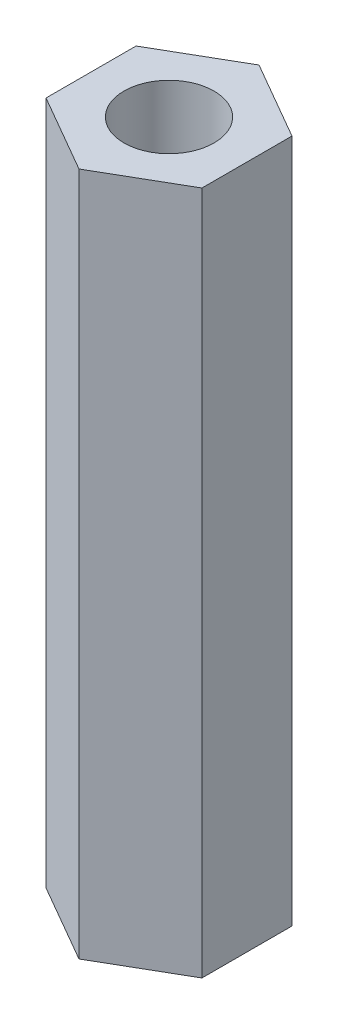
ISO-10303-21;
HEADER;
FILE_DESCRIPTION(('STEP AP214'),'2;1');
FILE_NAME('part.step','',(''),(''),'','','');
FILE_SCHEMA(('AUTOMOTIVE_DESIGN { 1 0 10303 214 1 1 1 1 }'));
ENDSEC;
DATA;
#1=APPLICATION_CONTEXT('core data for automotive mechanical design processes');
#2=APPLICATION_PROTOCOL_DEFINITION('international standard','automotive_design',2000,#1);
#3=PRODUCT_CONTEXT('',#1,'mechanical');
#4=PRODUCT('Part','Part','',(#3));
#5=PRODUCT_RELATED_PRODUCT_CATEGORY('part','',(#4));
#6=PRODUCT_DEFINITION_FORMATION('','',#4);
#7=PRODUCT_DEFINITION_CONTEXT('part definition',#1,'design');
#8=PRODUCT_DEFINITION('design','',#6,#7);
#9=PRODUCT_DEFINITION_SHAPE('','',#8);
#10=(LENGTH_UNIT() NAMED_UNIT(*) SI_UNIT(.MILLI.,.METRE.));
#11=(NAMED_UNIT(*) PLANE_ANGLE_UNIT() SI_UNIT($,.RADIAN.));
#12=(NAMED_UNIT(*) SI_UNIT($,.STERADIAN.) SOLID_ANGLE_UNIT());
#13=UNCERTAINTY_MEASURE_WITH_UNIT(LENGTH_MEASURE(1.E-05),#10,'distance_accuracy_value','');
#14=(GEOMETRIC_REPRESENTATION_CONTEXT(3) GLOBAL_UNCERTAINTY_ASSIGNED_CONTEXT((#13)) GLOBAL_UNIT_ASSIGNED_CONTEXT((#10,
#11,#12)) REPRESENTATION_CONTEXT('',''));
#15=CARTESIAN_POINT('',(0.,0.,0.));
#16=DIRECTION('',(0.,0.,1.));
#17=DIRECTION('',(1.,0.,0.));
#18=AXIS2_PLACEMENT_3D('',#15,#16,#17);
#19=CARTESIAN_POINT('',(0.,38.,-5.));
#20=DIRECTION('',(0.,1.,0.));
#21=DIRECTION('',(0.,0.,1.));
#22=AXIS2_PLACEMENT_3D('',#19,#20,#21);
#23=PLANE('',#22);
#24=DIRECTION('',(-0.866025403784439,0.,-0.5));
#25=VECTOR('',#24,1.);
#26=CARTESIAN_POINT('',(4.33012701892219,38.,-2.5));
#27=LINE('',#26,#25);
#28=CARTESIAN_POINT('',(4.33012701892219,38.,-2.5));
#29=VERTEX_POINT('',#28);
#30=CARTESIAN_POINT('',(0.,38.,-5.));
#31=VERTEX_POINT('',#30);
#32=EDGE_CURVE('E129',#29,#31,#27,.T.);
#33=ORIENTED_EDGE('',*,*,#32,.T.);
#34=DIRECTION('',(-0.866025403784439,0.,0.5));
#35=VECTOR('',#34,1.);
#36=CARTESIAN_POINT('',(0.,38.,-5.));
#37=LINE('',#36,#35);
#38=CARTESIAN_POINT('',(-4.33012701892219,38.,-2.5));
#39=VERTEX_POINT('',#38);
#40=EDGE_CURVE('E87',#31,#39,#37,.T.);
#41=ORIENTED_EDGE('',*,*,#40,.T.);
#42=DIRECTION('',(0.,0.,1.));
#43=VECTOR('',#42,1.);
#44=CARTESIAN_POINT('',(-4.33012701892219,38.,-2.5));
#45=LINE('',#44,#43);
#46=CARTESIAN_POINT('',(-4.33012701892219,38.,2.5));
#47=VERTEX_POINT('',#46);
#48=EDGE_CURVE('E100',#39,#47,#45,.T.);
#49=ORIENTED_EDGE('',*,*,#48,.T.);
#50=DIRECTION('',(0.866025403784439,0.,0.5));
#51=VECTOR('',#50,1.);
#52=CARTESIAN_POINT('',(-4.33012701892219,38.,2.5));
#53=LINE('',#52,#51);
#54=CARTESIAN_POINT('',(0.,38.,5.));
#55=VERTEX_POINT('',#54);
#56=EDGE_CURVE('E94',#47,#55,#53,.T.);
#57=ORIENTED_EDGE('',*,*,#56,.T.);
#58=DIRECTION('',(0.866025403784439,0.,-0.5));
#59=VECTOR('',#58,1.);
#60=CARTESIAN_POINT('',(0.,38.,5.));
#61=LINE('',#60,#59);
#62=CARTESIAN_POINT('',(4.33012701892219,38.,2.5));
#63=VERTEX_POINT('',#62);
#64=EDGE_CURVE('E98',#55,#63,#61,.T.);
#65=ORIENTED_EDGE('',*,*,#64,.T.);
#66=DIRECTION('',(0.,0.,-1.));
#67=VECTOR('',#66,1.);
#68=CARTESIAN_POINT('',(4.33012701892219,38.,2.5));
#69=LINE('',#68,#67);
#70=EDGE_CURVE('E50',#63,#29,#69,.T.);
#71=ORIENTED_EDGE('',*,*,#70,.T.);
#72=EDGE_LOOP('',(#33,#41,#49,#57,#65,#71));
#73=FACE_BOUND('',#72,.T.);
#74=CARTESIAN_POINT('',(0.,38.,0.));
#75=DIRECTION('',(0.,1.,0.));
#76=DIRECTION('',(0.,0.,1.));
#77=AXIS2_PLACEMENT_3D('',#74,#75,#76);
#78=CIRCLE('',#77,2.5);
#79=CARTESIAN_POINT('',(0.,38.,2.5));
#80=VERTEX_POINT('',#79);
#81=EDGE_CURVE('E122',#80,#80,#78,.T.);
#82=ORIENTED_EDGE('',*,*,#81,.F.);
#83=EDGE_LOOP('',(#82));
#84=FACE_BOUND('',#83,.T.);
#85=ADVANCED_FACE('F33',(#73,#84),#23,.T.);
#86=CARTESIAN_POINT('',(0.,0.,-5.));
#87=DIRECTION('',(0.,1.,0.));
#88=DIRECTION('',(0.,0.,1.));
#89=AXIS2_PLACEMENT_3D('',#86,#87,#88);
#90=PLANE('',#89);
#91=DIRECTION('',(-0.866025403784439,0.,-0.5));
#92=VECTOR('',#91,1.);
#93=CARTESIAN_POINT('',(4.33012701892219,0.,-2.5));
#94=LINE('',#93,#92);
#95=CARTESIAN_POINT('',(4.33012701892219,0.,-2.5));
#96=VERTEX_POINT('',#95);
#97=CARTESIAN_POINT('',(0.,0.,-5.));
#98=VERTEX_POINT('',#97);
#99=EDGE_CURVE('E118',#96,#98,#94,.T.);
#100=ORIENTED_EDGE('',*,*,#99,.F.);
#101=DIRECTION('',(0.,0.,-1.));
#102=VECTOR('',#101,1.);
#103=CARTESIAN_POINT('',(4.33012701892219,0.,2.5));
#104=LINE('',#103,#102);
#105=CARTESIAN_POINT('',(4.33012701892219,0.,2.5));
#106=VERTEX_POINT('',#105);
#107=EDGE_CURVE('E79',#106,#96,#104,.T.);
#108=ORIENTED_EDGE('',*,*,#107,.F.);
#109=DIRECTION('',(0.866025403784439,0.,-0.5));
#110=VECTOR('',#109,1.);
#111=CARTESIAN_POINT('',(0.,0.,5.));
#112=LINE('',#111,#110);
#113=CARTESIAN_POINT('',(0.,0.,5.));
#114=VERTEX_POINT('',#113);
#115=EDGE_CURVE('E73',#114,#106,#112,.T.);
#116=ORIENTED_EDGE('',*,*,#115,.F.);
#117=DIRECTION('',(0.866025403784439,0.,0.5));
#118=VECTOR('',#117,1.);
#119=CARTESIAN_POINT('',(-4.33012701892219,0.,2.5));
#120=LINE('',#119,#118);
#121=CARTESIAN_POINT('',(-4.33012701892219,0.,2.5));
#122=VERTEX_POINT('',#121);
#123=EDGE_CURVE('E108',#122,#114,#120,.T.);
#124=ORIENTED_EDGE('',*,*,#123,.F.);
#125=DIRECTION('',(0.,0.,1.));
#126=VECTOR('',#125,1.);
#127=CARTESIAN_POINT('',(-4.33012701892219,0.,-2.5));
#128=LINE('',#127,#126);
#129=CARTESIAN_POINT('',(-4.33012701892219,0.,-2.5));
#130=VERTEX_POINT('',#129);
#131=EDGE_CURVE('E124',#130,#122,#128,.T.);
#132=ORIENTED_EDGE('',*,*,#131,.F.);
#133=DIRECTION('',(-0.866025403784439,0.,0.5));
#134=VECTOR('',#133,1.);
#135=CARTESIAN_POINT('',(0.,0.,-5.));
#136=LINE('',#135,#134);
#137=EDGE_CURVE('E121',#98,#130,#136,.T.);
#138=ORIENTED_EDGE('',*,*,#137,.F.);
#139=EDGE_LOOP('',(#100,#108,#116,#124,#132,#138));
#140=FACE_BOUND('',#139,.T.);
#141=CARTESIAN_POINT('',(0.,0.,0.));
#142=DIRECTION('',(0.,1.,0.));
#143=DIRECTION('',(0.,0.,1.));
#144=AXIS2_PLACEMENT_3D('',#141,#142,#143);
#145=CIRCLE('',#144,2.5);
#146=CARTESIAN_POINT('',(0.,0.,2.5));
#147=VERTEX_POINT('',#146);
#148=EDGE_CURVE('E222',#147,#147,#145,.T.);
#149=ORIENTED_EDGE('',*,*,#148,.T.);
#150=EDGE_LOOP('',(#149));
#151=FACE_BOUND('',#150,.T.);
#152=ADVANCED_FACE('F138',(#140,#151),#90,.F.);
#153=CARTESIAN_POINT('',(4.33012701892219,38.,-2.5));
#154=DIRECTION('',(-0.5,0.,0.866025403784439));
#155=DIRECTION('',(0.866025403784439,0.,0.5));
#156=AXIS2_PLACEMENT_3D('',#153,#154,#155);
#157=PLANE('',#156);
#158=ORIENTED_EDGE('',*,*,#99,.T.);
#159=DIRECTION('',(0.,-1.,0.));
#160=VECTOR('',#159,1.);
#161=CARTESIAN_POINT('',(0.,38.,-5.));
#162=LINE('',#161,#160);
#163=EDGE_CURVE('E11',#31,#98,#162,.T.);
#164=ORIENTED_EDGE('',*,*,#163,.F.);
#165=ORIENTED_EDGE('',*,*,#32,.F.);
#166=DIRECTION('',(0.,-1.,0.));
#167=VECTOR('',#166,1.);
#168=CARTESIAN_POINT('',(4.33012701892219,38.,-2.5));
#169=LINE('',#168,#167);
#170=EDGE_CURVE('E114',#29,#96,#169,.T.);
#171=ORIENTED_EDGE('',*,*,#170,.T.);
#172=EDGE_LOOP('',(#158,#164,#165,#171));
#173=FACE_BOUND('',#172,.T.);
#174=ADVANCED_FACE('F35',(#173),#157,.F.);
#175=CARTESIAN_POINT('',(0.,38.,-5.));
#176=DIRECTION('',(0.5,0.,0.866025403784439));
#177=DIRECTION('',(0.866025403784439,0.,-0.5));
#178=AXIS2_PLACEMENT_3D('',#175,#176,#177);
#179=PLANE('',#178);
#180=ORIENTED_EDGE('',*,*,#137,.T.);
#181=DIRECTION('',(0.,-1.,0.));
#182=VECTOR('',#181,1.);
#183=CARTESIAN_POINT('',(-4.33012701892219,38.,-2.5));
#184=LINE('',#183,#182);
#185=EDGE_CURVE('E42',#39,#130,#184,.T.);
#186=ORIENTED_EDGE('',*,*,#185,.F.);
#187=ORIENTED_EDGE('',*,*,#40,.F.);
#188=ORIENTED_EDGE('',*,*,#163,.T.);
#189=EDGE_LOOP('',(#180,#186,#187,#188));
#190=FACE_BOUND('',#189,.T.);
#191=ADVANCED_FACE('F163',(#190),#179,.F.);
#192=CARTESIAN_POINT('',(-4.33012701892219,38.,-2.5));
#193=DIRECTION('',(1.,0.,0.));
#194=DIRECTION('',(0.,0.,-1.));
#195=AXIS2_PLACEMENT_3D('',#192,#193,#194);
#196=PLANE('',#195);
#197=ORIENTED_EDGE('',*,*,#131,.T.);
#198=DIRECTION('',(0.,-1.,0.));
#199=VECTOR('',#198,1.);
#200=CARTESIAN_POINT('',(-4.33012701892219,38.,2.5));
#201=LINE('',#200,#199);
#202=EDGE_CURVE('E109',#47,#122,#201,.T.);
#203=ORIENTED_EDGE('',*,*,#202,.F.);
#204=ORIENTED_EDGE('',*,*,#48,.F.);
#205=ORIENTED_EDGE('',*,*,#185,.T.);
#206=EDGE_LOOP('',(#197,#203,#204,#205));
#207=FACE_BOUND('',#206,.T.);
#208=ADVANCED_FACE('F135',(#207),#196,.F.);
#209=CARTESIAN_POINT('',(-4.33012701892219,38.,2.5));
#210=DIRECTION('',(0.5,0.,-0.866025403784439));
#211=DIRECTION('',(-0.866025403784439,0.,-0.5));
#212=AXIS2_PLACEMENT_3D('',#209,#210,#211);
#213=PLANE('',#212);
#214=ORIENTED_EDGE('',*,*,#123,.T.);
#215=DIRECTION('',(0.,-1.,0.));
#216=VECTOR('',#215,1.);
#217=CARTESIAN_POINT('',(0.,38.,5.));
#218=LINE('',#217,#216);
#219=EDGE_CURVE('E105',#55,#114,#218,.T.);
#220=ORIENTED_EDGE('',*,*,#219,.F.);
#221=ORIENTED_EDGE('',*,*,#56,.F.);
#222=ORIENTED_EDGE('',*,*,#202,.T.);
#223=EDGE_LOOP('',(#214,#220,#221,#222));
#224=FACE_BOUND('',#223,.T.);
#225=ADVANCED_FACE('F106',(#224),#213,.F.);
#226=CARTESIAN_POINT('',(0.,38.,5.));
#227=DIRECTION('',(-0.5,0.,-0.866025403784439));
#228=DIRECTION('',(-0.866025403784439,0.,0.5));
#229=AXIS2_PLACEMENT_3D('',#226,#227,#228);
#230=PLANE('',#229);
#231=ORIENTED_EDGE('',*,*,#115,.T.);
#232=DIRECTION('',(0.,-1.,0.));
#233=VECTOR('',#232,1.);
#234=CARTESIAN_POINT('',(4.33012701892219,38.,2.5));
#235=LINE('',#234,#233);
#236=EDGE_CURVE('E110',#63,#106,#235,.T.);
#237=ORIENTED_EDGE('',*,*,#236,.F.);
#238=ORIENTED_EDGE('',*,*,#64,.F.);
#239=ORIENTED_EDGE('',*,*,#219,.T.);
#240=EDGE_LOOP('',(#231,#237,#238,#239));
#241=FACE_BOUND('',#240,.T.);
#242=ADVANCED_FACE('F112',(#241),#230,.F.);
#243=CARTESIAN_POINT('',(4.33012701892219,38.,2.5));
#244=DIRECTION('',(-1.,0.,0.));
#245=DIRECTION('',(0.,0.,1.));
#246=AXIS2_PLACEMENT_3D('',#243,#244,#245);
#247=PLANE('',#246);
#248=ORIENTED_EDGE('',*,*,#107,.T.);
#249=ORIENTED_EDGE('',*,*,#170,.F.);
#250=ORIENTED_EDGE('',*,*,#70,.F.);
#251=ORIENTED_EDGE('',*,*,#236,.T.);
#252=EDGE_LOOP('',(#248,#249,#250,#251));
#253=FACE_BOUND('',#252,.T.);
#254=ADVANCED_FACE('F143',(#253),#247,.F.);
#255=CARTESIAN_POINT('',(0.,38.,0.));
#256=DIRECTION('',(0.,-1.,0.));
#257=DIRECTION('',(0.,0.,-1.));
#258=AXIS2_PLACEMENT_3D('',#255,#256,#257);
#259=CYLINDRICAL_SURFACE('',#258,2.5);
#260=ORIENTED_EDGE('',*,*,#81,.T.);
#261=EDGE_LOOP('',(#260));
#262=FACE_BOUND('',#261,.T.);
#263=ORIENTED_EDGE('',*,*,#148,.F.);
#264=EDGE_LOOP('',(#263));
#265=FACE_BOUND('',#264,.T.);
#266=ADVANCED_FACE('F145',(#262,#265),#259,.F.);
#267=CLOSED_SHELL('',(#85,#152,#174,#191,#208,#225,#242,#254,#266));
#268=MANIFOLD_SOLID_BREP('B2',#267);
#269=ADVANCED_BREP_SHAPE_REPRESENTATION('',(#18,#268),#14);
#270=SHAPE_DEFINITION_REPRESENTATION(#9,#269);
ENDSEC;
END-ISO-10303-21;
